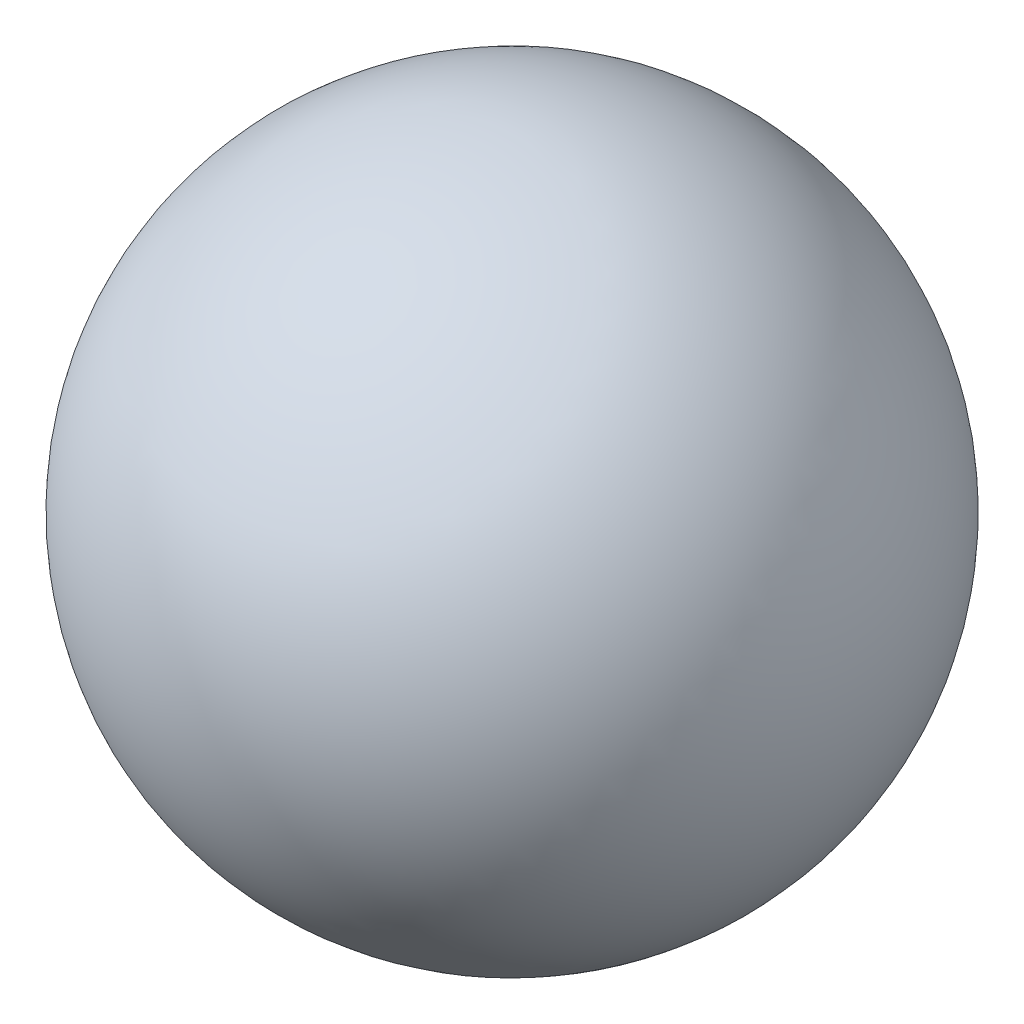
ISO-10303-21;
HEADER;
FILE_DESCRIPTION(('STEP AP214'),'2;1');
FILE_NAME('part.step','',(''),(''),'','','');
FILE_SCHEMA(('AUTOMOTIVE_DESIGN { 1 0 10303 214 1 1 1 1 }'));
ENDSEC;
DATA;
#1=APPLICATION_CONTEXT('core data for automotive mechanical design processes');
#2=APPLICATION_PROTOCOL_DEFINITION('international standard','automotive_design',2000,#1);
#3=PRODUCT_CONTEXT('',#1,'mechanical');
#4=PRODUCT('Part','Part','',(#3));
#5=PRODUCT_RELATED_PRODUCT_CATEGORY('part','',(#4));
#6=PRODUCT_DEFINITION_FORMATION('','',#4);
#7=PRODUCT_DEFINITION_CONTEXT('part definition',#1,'design');
#8=PRODUCT_DEFINITION('design','',#6,#7);
#9=PRODUCT_DEFINITION_SHAPE('','',#8);
#10=(LENGTH_UNIT() NAMED_UNIT(*) SI_UNIT(.MILLI.,.METRE.));
#11=(NAMED_UNIT(*) PLANE_ANGLE_UNIT() SI_UNIT($,.RADIAN.));
#12=(NAMED_UNIT(*) SI_UNIT($,.STERADIAN.) SOLID_ANGLE_UNIT());
#13=UNCERTAINTY_MEASURE_WITH_UNIT(LENGTH_MEASURE(1.E-05),#10,'distance_accuracy_value','');
#14=(GEOMETRIC_REPRESENTATION_CONTEXT(3) GLOBAL_UNCERTAINTY_ASSIGNED_CONTEXT((#13)) GLOBAL_UNIT_ASSIGNED_CONTEXT((#10,
#11,#12)) REPRESENTATION_CONTEXT('',''));
#15=CARTESIAN_POINT('',(0.,0.,0.));
#16=DIRECTION('',(0.,0.,1.));
#17=DIRECTION('',(1.,0.,0.));
#18=AXIS2_PLACEMENT_3D('',#15,#16,#17);
#19=CARTESIAN_POINT('',(64.16,-67.8060174553842,-14.7086602326703));
#20=DIRECTION('',(0.,-0.977271341040084,-0.211992278118133));
#21=DIRECTION('',(0.173648177666934,0.208771639069458,-0.962424393452912));
#22=AXIS2_PLACEMENT_3D('',#19,#20,#21);
#23=SPHERICAL_SURFACE('',#22,7.15);
#24=CARTESIAN_POINT('',(64.16,-60.8185273669476,-13.1929154441257));
#25=VERTEX_POINT('',#24);
#26=VERTEX_LOOP('',#25);
#27=FACE_BOUND('',#26,.T.);
#28=CARTESIAN_POINT('',(64.16,-74.7935075438208,-16.224405021215));
#29=VERTEX_POINT('',#28);
#30=VERTEX_LOOP('',#29);
#31=FACE_BOUND('',#30,.T.);
#32=ADVANCED_FACE('F15',(#27,#31),#23,.T.);
#33=CLOSED_SHELL('',(#32));
#34=MANIFOLD_SOLID_BREP('B1',#33);
#35=ADVANCED_BREP_SHAPE_REPRESENTATION('',(#18,#34),#14);
#36=SHAPE_DEFINITION_REPRESENTATION(#9,#35);
ENDSEC;
END-ISO-10303-21;
